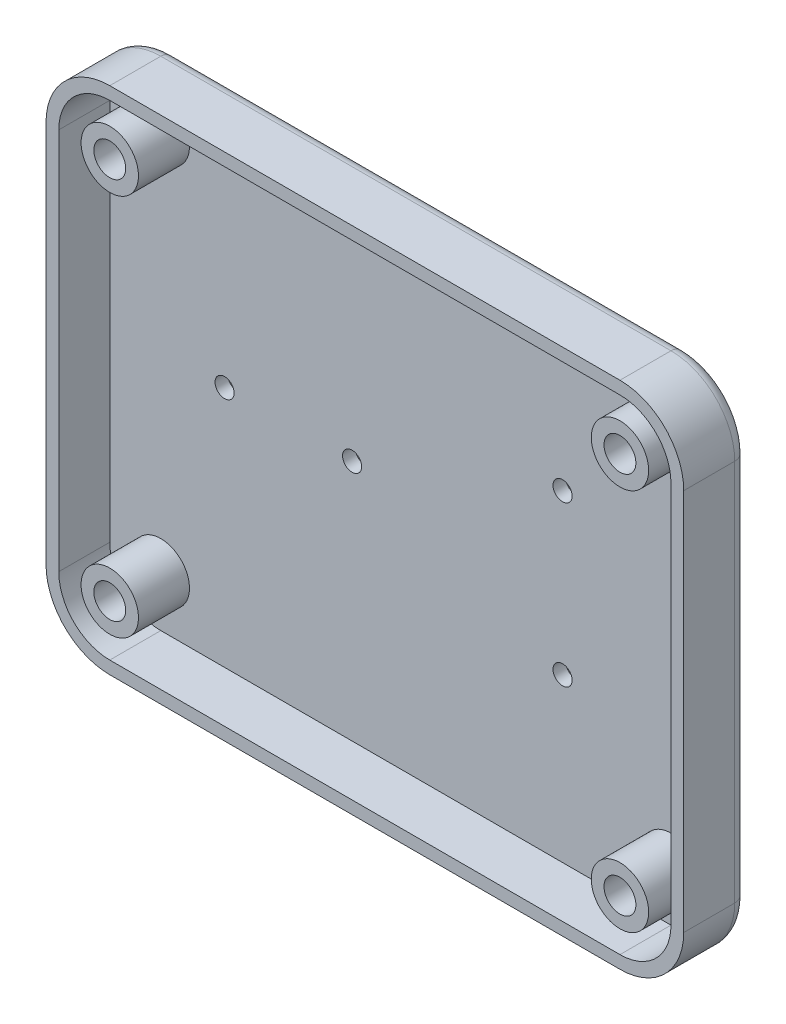
ISO-10303-21;
HEADER;
FILE_DESCRIPTION(('STEP AP214'),'2;1');
FILE_NAME('part.step','',(''),(''),'','','');
FILE_SCHEMA(('AUTOMOTIVE_DESIGN { 1 0 10303 214 1 1 1 1 }'));
ENDSEC;
DATA;
#1=APPLICATION_CONTEXT('core data for automotive mechanical design processes');
#2=APPLICATION_PROTOCOL_DEFINITION('international standard','automotive_design',2000,#1);
#3=PRODUCT_CONTEXT('',#1,'mechanical');
#4=PRODUCT('Part','Part','',(#3));
#5=PRODUCT_RELATED_PRODUCT_CATEGORY('part','',(#4));
#6=PRODUCT_DEFINITION_FORMATION('','',#4);
#7=PRODUCT_DEFINITION_CONTEXT('part definition',#1,'design');
#8=PRODUCT_DEFINITION('design','',#6,#7);
#9=PRODUCT_DEFINITION_SHAPE('','',#8);
#10=(LENGTH_UNIT() NAMED_UNIT(*) SI_UNIT(.MILLI.,.METRE.));
#11=(NAMED_UNIT(*) PLANE_ANGLE_UNIT() SI_UNIT($,.RADIAN.));
#12=(NAMED_UNIT(*) SI_UNIT($,.STERADIAN.) SOLID_ANGLE_UNIT());
#13=UNCERTAINTY_MEASURE_WITH_UNIT(LENGTH_MEASURE(1.E-05),#10,'distance_accuracy_value','');
#14=(GEOMETRIC_REPRESENTATION_CONTEXT(3) GLOBAL_UNCERTAINTY_ASSIGNED_CONTEXT((#13)) GLOBAL_UNIT_ASSIGNED_CONTEXT((#10,
#11,#12)) REPRESENTATION_CONTEXT('',''));
#15=CARTESIAN_POINT('',(0.,0.,0.));
#16=DIRECTION('',(0.,0.,1.));
#17=DIRECTION('',(1.,0.,0.));
#18=AXIS2_PLACEMENT_3D('',#15,#16,#17);
#19=CARTESIAN_POINT('',(0.,0.,10.));
#20=DIRECTION('',(0.,0.,-1.));
#21=DIRECTION('',(-1.,0.,0.));
#22=AXIS2_PLACEMENT_3D('',#19,#20,#21);
#23=PLANE('',#22);
#24=CARTESIAN_POINT('',(-40.,30.,10.));
#25=DIRECTION('',(0.,0.,-1.));
#26=DIRECTION('',(-1.,0.,0.));
#27=AXIS2_PLACEMENT_3D('',#24,#25,#26);
#28=CIRCLE('',#27,4.5);
#29=CARTESIAN_POINT('',(-44.5,30.,10.));
#30=VERTEX_POINT('',#29);
#31=EDGE_CURVE('E226',#30,#30,#28,.T.);
#32=ORIENTED_EDGE('',*,*,#31,.F.);
#33=EDGE_LOOP('',(#32));
#34=FACE_BOUND('',#33,.T.);
#35=CARTESIAN_POINT('',(-40.,30.,10.));
#36=DIRECTION('',(0.,0.,-1.));
#37=DIRECTION('',(-1.,0.,0.));
#38=AXIS2_PLACEMENT_3D('',#35,#36,#37);
#39=CIRCLE('',#38,2.5);
#40=CARTESIAN_POINT('',(-42.5,30.,10.));
#41=VERTEX_POINT('',#40);
#42=EDGE_CURVE('E286',#41,#41,#39,.T.);
#43=ORIENTED_EDGE('',*,*,#42,.T.);
#44=EDGE_LOOP('',(#43));
#45=FACE_BOUND('',#44,.T.);
#46=ADVANCED_FACE('F35',(#34,#45),#23,.F.);
#47=CARTESIAN_POINT('',(40.,30.,10.));
#48=DIRECTION('',(0.,0.,-1.));
#49=DIRECTION('',(-1.,0.,0.));
#50=AXIS2_PLACEMENT_3D('',#47,#48,#49);
#51=CIRCLE('',#50,4.5);
#52=CARTESIAN_POINT('',(35.5,30.,10.));
#53=VERTEX_POINT('',#52);
#54=EDGE_CURVE('E231',#53,#53,#51,.T.);
#55=ORIENTED_EDGE('',*,*,#54,.F.);
#56=EDGE_LOOP('',(#55));
#57=FACE_BOUND('',#56,.T.);
#58=CARTESIAN_POINT('',(40.,30.,10.));
#59=DIRECTION('',(0.,0.,-1.));
#60=DIRECTION('',(-1.,0.,0.));
#61=AXIS2_PLACEMENT_3D('',#58,#59,#60);
#62=CIRCLE('',#61,2.5);
#63=CARTESIAN_POINT('',(37.5,30.,10.));
#64=VERTEX_POINT('',#63);
#65=EDGE_CURVE('E280',#64,#64,#62,.T.);
#66=ORIENTED_EDGE('',*,*,#65,.T.);
#67=EDGE_LOOP('',(#66));
#68=FACE_BOUND('',#67,.T.);
#69=ADVANCED_FACE('F455',(#57,#68),#23,.F.);
#70=CARTESIAN_POINT('',(40.,-30.,10.));
#71=DIRECTION('',(0.,0.,-1.));
#72=DIRECTION('',(-1.,0.,0.));
#73=AXIS2_PLACEMENT_3D('',#70,#71,#72);
#74=CIRCLE('',#73,4.5);
#75=CARTESIAN_POINT('',(35.5,-30.,10.));
#76=VERTEX_POINT('',#75);
#77=EDGE_CURVE('E235',#76,#76,#74,.T.);
#78=ORIENTED_EDGE('',*,*,#77,.F.);
#79=EDGE_LOOP('',(#78));
#80=FACE_BOUND('',#79,.T.);
#81=CARTESIAN_POINT('',(40.,-30.,10.));
#82=DIRECTION('',(0.,0.,-1.));
#83=DIRECTION('',(-1.,0.,0.));
#84=AXIS2_PLACEMENT_3D('',#81,#82,#83);
#85=CIRCLE('',#84,2.5);
#86=CARTESIAN_POINT('',(37.5,-30.,10.));
#87=VERTEX_POINT('',#86);
#88=EDGE_CURVE('E273',#87,#87,#85,.T.);
#89=ORIENTED_EDGE('',*,*,#88,.T.);
#90=EDGE_LOOP('',(#89));
#91=FACE_BOUND('',#90,.T.);
#92=ADVANCED_FACE('F461',(#80,#91),#23,.F.);
#93=CARTESIAN_POINT('',(-40.,-30.,10.));
#94=DIRECTION('',(0.,0.,-1.));
#95=DIRECTION('',(-1.,0.,0.));
#96=AXIS2_PLACEMENT_3D('',#93,#94,#95);
#97=CIRCLE('',#96,4.5);
#98=CARTESIAN_POINT('',(-44.5,-30.,10.));
#99=VERTEX_POINT('',#98);
#100=EDGE_CURVE('E239',#99,#99,#97,.T.);
#101=ORIENTED_EDGE('',*,*,#100,.F.);
#102=EDGE_LOOP('',(#101));
#103=FACE_BOUND('',#102,.T.);
#104=CARTESIAN_POINT('',(-40.,-30.,10.));
#105=DIRECTION('',(0.,0.,-1.));
#106=DIRECTION('',(-1.,0.,0.));
#107=AXIS2_PLACEMENT_3D('',#104,#105,#106);
#108=CIRCLE('',#107,2.5);
#109=CARTESIAN_POINT('',(-42.5,-30.,10.));
#110=VERTEX_POINT('',#109);
#111=EDGE_CURVE('E292',#110,#110,#108,.T.);
#112=ORIENTED_EDGE('',*,*,#111,.T.);
#113=EDGE_LOOP('',(#112));
#114=FACE_BOUND('',#113,.T.);
#115=ADVANCED_FACE('F470',(#103,#114),#23,.F.);
#116=CARTESIAN_POINT('',(50.,-40.,10.));
#117=DIRECTION('',(-1.,0.,0.));
#118=DIRECTION('',(0.,0.,1.));
#119=AXIS2_PLACEMENT_3D('',#116,#117,#118);
#120=PLANE('',#119);
#121=DIRECTION('',(0.,0.,-1.));
#122=VECTOR('',#121,1.);
#123=CARTESIAN_POINT('',(50.,-30.,10.));
#124=LINE('',#123,#122);
#125=CARTESIAN_POINT('',(50.,-30.,10.));
#126=VERTEX_POINT('',#125);
#127=CARTESIAN_POINT('',(50.,-30.,2.));
#128=VERTEX_POINT('',#127);
#129=EDGE_CURVE('E329',#126,#128,#124,.T.);
#130=ORIENTED_EDGE('',*,*,#129,.T.);
#131=DIRECTION('',(0.,1.,0.));
#132=VECTOR('',#131,1.);
#133=CARTESIAN_POINT('',(50.,30.,2.));
#134=LINE('',#133,#132);
#135=CARTESIAN_POINT('',(50.,30.,2.));
#136=VERTEX_POINT('',#135);
#137=EDGE_CURVE('E356',#128,#136,#134,.T.);
#138=ORIENTED_EDGE('',*,*,#137,.T.);
#139=DIRECTION('',(0.,0.,-1.));
#140=VECTOR('',#139,1.);
#141=CARTESIAN_POINT('',(50.,30.,10.));
#142=LINE('',#141,#140);
#143=CARTESIAN_POINT('',(50.,30.,10.));
#144=VERTEX_POINT('',#143);
#145=EDGE_CURVE('E327',#136,#144,#142,.F.);
#146=ORIENTED_EDGE('',*,*,#145,.T.);
#147=DIRECTION('',(0.,1.,0.));
#148=VECTOR('',#147,1.);
#149=CARTESIAN_POINT('',(50.,-40.,10.));
#150=LINE('',#149,#148);
#151=EDGE_CURVE('E295',#126,#144,#150,.T.);
#152=ORIENTED_EDGE('',*,*,#151,.F.);
#153=EDGE_LOOP('',(#130,#138,#146,#152));
#154=FACE_BOUND('',#153,.T.);
#155=ADVANCED_FACE('F417',(#154),#120,.F.);
#156=CARTESIAN_POINT('',(-50.,40.,10.));
#157=DIRECTION('',(0.,-1.,0.));
#158=DIRECTION('',(0.,0.,-1.));
#159=AXIS2_PLACEMENT_3D('',#156,#157,#158);
#160=PLANE('',#159);
#161=DIRECTION('',(0.,0.,-1.));
#162=VECTOR('',#161,1.);
#163=CARTESIAN_POINT('',(40.,40.,10.));
#164=LINE('',#163,#162);
#165=CARTESIAN_POINT('',(40.,40.,10.));
#166=VERTEX_POINT('',#165);
#167=CARTESIAN_POINT('',(40.,40.,2.));
#168=VERTEX_POINT('',#167);
#169=EDGE_CURVE('E334',#166,#168,#164,.T.);
#170=ORIENTED_EDGE('',*,*,#169,.T.);
#171=DIRECTION('',(-1.,0.,0.));
#172=VECTOR('',#171,1.);
#173=CARTESIAN_POINT('',(-40.,40.,2.));
#174=LINE('',#173,#172);
#175=CARTESIAN_POINT('',(-40.,40.,2.));
#176=VERTEX_POINT('',#175);
#177=EDGE_CURVE('E11',#168,#176,#174,.T.);
#178=ORIENTED_EDGE('',*,*,#177,.T.);
#179=DIRECTION('',(0.,0.,-1.));
#180=VECTOR('',#179,1.);
#181=CARTESIAN_POINT('',(-40.,40.,10.));
#182=LINE('',#181,#180);
#183=CARTESIAN_POINT('',(-40.,40.,10.));
#184=VERTEX_POINT('',#183);
#185=EDGE_CURVE('E332',#176,#184,#182,.F.);
#186=ORIENTED_EDGE('',*,*,#185,.T.);
#187=DIRECTION('',(-1.,0.,0.));
#188=VECTOR('',#187,1.);
#189=CARTESIAN_POINT('',(-50.,40.,10.));
#190=LINE('',#189,#188);
#191=EDGE_CURVE('E300',#166,#184,#190,.T.);
#192=ORIENTED_EDGE('',*,*,#191,.F.);
#193=EDGE_LOOP('',(#170,#178,#186,#192));
#194=FACE_BOUND('',#193,.T.);
#195=ADVANCED_FACE('F437',(#194),#160,.F.);
#196=CARTESIAN_POINT('',(-50.,-40.,10.));
#197=DIRECTION('',(1.,0.,0.));
#198=DIRECTION('',(0.,0.,-1.));
#199=AXIS2_PLACEMENT_3D('',#196,#197,#198);
#200=PLANE('',#199);
#201=DIRECTION('',(0.,0.,-1.));
#202=VECTOR('',#201,1.);
#203=CARTESIAN_POINT('',(-50.,30.,10.));
#204=LINE('',#203,#202);
#205=CARTESIAN_POINT('',(-50.,30.,10.));
#206=VERTEX_POINT('',#205);
#207=CARTESIAN_POINT('',(-50.,30.,2.));
#208=VERTEX_POINT('',#207);
#209=EDGE_CURVE('E314',#206,#208,#204,.T.);
#210=ORIENTED_EDGE('',*,*,#209,.T.);
#211=DIRECTION('',(0.,-1.,0.));
#212=VECTOR('',#211,1.);
#213=CARTESIAN_POINT('',(-50.,-30.,2.));
#214=LINE('',#213,#212);
#215=CARTESIAN_POINT('',(-50.,-30.,2.));
#216=VERTEX_POINT('',#215);
#217=EDGE_CURVE('E364',#208,#216,#214,.T.);
#218=ORIENTED_EDGE('',*,*,#217,.T.);
#219=DIRECTION('',(0.,0.,-1.));
#220=VECTOR('',#219,1.);
#221=CARTESIAN_POINT('',(-50.,-30.,10.));
#222=LINE('',#221,#220);
#223=CARTESIAN_POINT('',(-50.,-30.,10.));
#224=VERTEX_POINT('',#223);
#225=EDGE_CURVE('E317',#216,#224,#222,.F.);
#226=ORIENTED_EDGE('',*,*,#225,.T.);
#227=DIRECTION('',(0.,-1.,0.));
#228=VECTOR('',#227,1.);
#229=CARTESIAN_POINT('',(-50.,-40.,10.));
#230=LINE('',#229,#228);
#231=EDGE_CURVE('E303',#206,#224,#230,.T.);
#232=ORIENTED_EDGE('',*,*,#231,.F.);
#233=EDGE_LOOP('',(#210,#218,#226,#232));
#234=FACE_BOUND('',#233,.T.);
#235=ADVANCED_FACE('F445',(#234),#200,.F.);
#236=CARTESIAN_POINT('',(-50.,-40.,10.));
#237=DIRECTION('',(0.,1.,0.));
#238=DIRECTION('',(0.,0.,1.));
#239=AXIS2_PLACEMENT_3D('',#236,#237,#238);
#240=PLANE('',#239);
#241=DIRECTION('',(0.,0.,-1.));
#242=VECTOR('',#241,1.);
#243=CARTESIAN_POINT('',(-40.,-40.,10.));
#244=LINE('',#243,#242);
#245=CARTESIAN_POINT('',(-40.,-40.,10.));
#246=VERTEX_POINT('',#245);
#247=CARTESIAN_POINT('',(-40.,-40.,2.));
#248=VERTEX_POINT('',#247);
#249=EDGE_CURVE('E311',#246,#248,#244,.T.);
#250=ORIENTED_EDGE('',*,*,#249,.T.);
#251=DIRECTION('',(1.,0.,0.));
#252=VECTOR('',#251,1.);
#253=CARTESIAN_POINT('',(40.,-40.,2.));
#254=LINE('',#253,#252);
#255=CARTESIAN_POINT('',(40.,-40.,2.));
#256=VERTEX_POINT('',#255);
#257=EDGE_CURVE('E360',#248,#256,#254,.T.);
#258=ORIENTED_EDGE('',*,*,#257,.T.);
#259=DIRECTION('',(0.,0.,-1.));
#260=VECTOR('',#259,1.);
#261=CARTESIAN_POINT('',(40.,-40.,10.));
#262=LINE('',#261,#260);
#263=CARTESIAN_POINT('',(40.,-40.,10.));
#264=VERTEX_POINT('',#263);
#265=EDGE_CURVE('E309',#256,#264,#262,.F.);
#266=ORIENTED_EDGE('',*,*,#265,.T.);
#267=DIRECTION('',(1.,0.,0.));
#268=VECTOR('',#267,1.);
#269=CARTESIAN_POINT('',(-50.,-40.,10.));
#270=LINE('',#269,#268);
#271=EDGE_CURVE('E306',#246,#264,#270,.T.);
#272=ORIENTED_EDGE('',*,*,#271,.F.);
#273=EDGE_LOOP('',(#250,#258,#266,#272));
#274=FACE_BOUND('',#273,.T.);
#275=ADVANCED_FACE('F404',(#274),#240,.F.);
#276=DIRECTION('',(0.,-1.,0.));
#277=VECTOR('',#276,1.);
#278=CARTESIAN_POINT('',(-48.,0.,10.));
#279=LINE('',#278,#277);
#280=CARTESIAN_POINT('',(-48.,30.,10.));
#281=VERTEX_POINT('',#280);
#282=CARTESIAN_POINT('',(-48.,-30.,10.));
#283=VERTEX_POINT('',#282);
#284=EDGE_CURVE('E257',#281,#283,#279,.T.);
#285=ORIENTED_EDGE('',*,*,#284,.F.);
#286=CARTESIAN_POINT('',(-40.,30.,10.));
#287=DIRECTION('',(0.,0.,-1.));
#288=DIRECTION('',(-1.,0.,0.));
#289=AXIS2_PLACEMENT_3D('',#286,#287,#288);
#290=CIRCLE('',#289,8.);
#291=CARTESIAN_POINT('',(-40.,38.,10.));
#292=VERTEX_POINT('',#291);
#293=EDGE_CURVE('E246',#292,#281,#290,.F.);
#294=ORIENTED_EDGE('',*,*,#293,.F.);
#295=DIRECTION('',(-1.,0.,0.));
#296=VECTOR('',#295,1.);
#297=CARTESIAN_POINT('',(0.,38.,10.));
#298=LINE('',#297,#296);
#299=CARTESIAN_POINT('',(40.,38.,10.));
#300=VERTEX_POINT('',#299);
#301=EDGE_CURVE('E52',#300,#292,#298,.T.);
#302=ORIENTED_EDGE('',*,*,#301,.F.);
#303=CARTESIAN_POINT('',(40.,30.,10.));
#304=DIRECTION('',(0.,0.,-1.));
#305=DIRECTION('',(-1.,0.,0.));
#306=AXIS2_PLACEMENT_3D('',#303,#304,#305);
#307=CIRCLE('',#306,8.);
#308=CARTESIAN_POINT('',(48.,30.,10.));
#309=VERTEX_POINT('',#308);
#310=EDGE_CURVE('E254',#309,#300,#307,.F.);
#311=ORIENTED_EDGE('',*,*,#310,.F.);
#312=DIRECTION('',(0.,1.,0.));
#313=VECTOR('',#312,1.);
#314=CARTESIAN_POINT('',(48.,0.,10.));
#315=LINE('',#314,#313);
#316=CARTESIAN_POINT('',(48.,-30.,10.));
#317=VERTEX_POINT('',#316);
#318=EDGE_CURVE('E252',#317,#309,#315,.T.);
#319=ORIENTED_EDGE('',*,*,#318,.F.);
#320=CARTESIAN_POINT('',(40.,-30.,10.));
#321=DIRECTION('',(0.,0.,-1.));
#322=DIRECTION('',(-1.,0.,0.));
#323=AXIS2_PLACEMENT_3D('',#320,#321,#322);
#324=CIRCLE('',#323,8.);
#325=CARTESIAN_POINT('',(40.,-38.,10.));
#326=VERTEX_POINT('',#325);
#327=EDGE_CURVE('E199',#326,#317,#324,.F.);
#328=ORIENTED_EDGE('',*,*,#327,.F.);
#329=DIRECTION('',(1.,0.,0.));
#330=VECTOR('',#329,1.);
#331=CARTESIAN_POINT('',(0.,-38.,10.));
#332=LINE('',#331,#330);
#333=CARTESIAN_POINT('',(-40.,-38.,10.));
#334=VERTEX_POINT('',#333);
#335=EDGE_CURVE('E251',#334,#326,#332,.T.);
#336=ORIENTED_EDGE('',*,*,#335,.F.);
#337=CARTESIAN_POINT('',(-40.,-30.,10.));
#338=DIRECTION('',(0.,0.,-1.));
#339=DIRECTION('',(-1.,0.,0.));
#340=AXIS2_PLACEMENT_3D('',#337,#338,#339);
#341=CIRCLE('',#340,8.);
#342=EDGE_CURVE('E204',#283,#334,#341,.F.);
#343=ORIENTED_EDGE('',*,*,#342,.F.);
#344=EDGE_LOOP('',(#285,#294,#302,#311,#319,#328,#336,#343));
#345=FACE_BOUND('',#344,.T.);
#346=ORIENTED_EDGE('',*,*,#231,.T.);
#347=CARTESIAN_POINT('',(-40.,-30.,10.));
#348=DIRECTION('',(0.,0.,-1.));
#349=DIRECTION('',(-1.,0.,0.));
#350=AXIS2_PLACEMENT_3D('',#347,#348,#349);
#351=CIRCLE('',#350,10.);
#352=EDGE_CURVE('E325',#224,#246,#351,.F.);
#353=ORIENTED_EDGE('',*,*,#352,.T.);
#354=ORIENTED_EDGE('',*,*,#271,.T.);
#355=CARTESIAN_POINT('',(40.,-30.,10.));
#356=DIRECTION('',(0.,0.,-1.));
#357=DIRECTION('',(-1.,0.,0.));
#358=AXIS2_PLACEMENT_3D('',#355,#356,#357);
#359=CIRCLE('',#358,10.);
#360=EDGE_CURVE('E323',#264,#126,#359,.F.);
#361=ORIENTED_EDGE('',*,*,#360,.T.);
#362=ORIENTED_EDGE('',*,*,#151,.T.);
#363=CARTESIAN_POINT('',(40.,30.,10.));
#364=DIRECTION('',(0.,0.,-1.));
#365=DIRECTION('',(-1.,0.,0.));
#366=AXIS2_PLACEMENT_3D('',#363,#364,#365);
#367=CIRCLE('',#366,10.);
#368=EDGE_CURVE('E321',#144,#166,#367,.F.);
#369=ORIENTED_EDGE('',*,*,#368,.T.);
#370=ORIENTED_EDGE('',*,*,#191,.T.);
#371=CARTESIAN_POINT('',(-40.,30.,10.));
#372=DIRECTION('',(0.,0.,-1.));
#373=DIRECTION('',(-1.,0.,0.));
#374=AXIS2_PLACEMENT_3D('',#371,#372,#373);
#375=CIRCLE('',#374,10.);
#376=EDGE_CURVE('E319',#184,#206,#375,.F.);
#377=ORIENTED_EDGE('',*,*,#376,.T.);
#378=EDGE_LOOP('',(#346,#353,#354,#361,#362,#369,#370,#377));
#379=FACE_BOUND('',#378,.T.);
#380=ADVANCED_FACE('F408',(#345,#379),#23,.F.);
#381=CARTESIAN_POINT('',(0.,0.,0.));
#382=DIRECTION('',(0.,0.,-1.));
#383=DIRECTION('',(-1.,0.,0.));
#384=AXIS2_PLACEMENT_3D('',#381,#382,#383);
#385=PLANE('',#384);
#386=CARTESIAN_POINT('',(23.,-12.5,0.));
#387=DIRECTION('',(0.,0.,1.));
#388=DIRECTION('',(1.,0.,0.));
#389=AXIS2_PLACEMENT_3D('',#386,#387,#388);
#390=CIRCLE('',#389,1.5);
#391=CARTESIAN_POINT('',(24.5,-12.5,0.));
#392=VERTEX_POINT('',#391);
#393=EDGE_CURVE('E590',#392,#392,#390,.T.);
#394=ORIENTED_EDGE('',*,*,#393,.T.);
#395=EDGE_LOOP('',(#394));
#396=FACE_BOUND('',#395,.T.);
#397=CARTESIAN_POINT('',(23.,12.5,0.));
#398=DIRECTION('',(0.,0.,1.));
#399=DIRECTION('',(1.,0.,0.));
#400=AXIS2_PLACEMENT_3D('',#397,#398,#399);
#401=CIRCLE('',#400,1.5);
#402=CARTESIAN_POINT('',(24.5,12.5,0.));
#403=VERTEX_POINT('',#402);
#404=EDGE_CURVE('E581',#403,#403,#401,.T.);
#405=ORIENTED_EDGE('',*,*,#404,.T.);
#406=EDGE_LOOP('',(#405));
#407=FACE_BOUND('',#406,.T.);
#408=CARTESIAN_POINT('',(-30.,0.,0.));
#409=DIRECTION('',(0.,0.,1.));
#410=DIRECTION('',(1.,0.,0.));
#411=AXIS2_PLACEMENT_3D('',#408,#409,#410);
#412=CIRCLE('',#411,1.5);
#413=CARTESIAN_POINT('',(-28.5,0.,0.));
#414=VERTEX_POINT('',#413);
#415=EDGE_CURVE('E576',#414,#414,#412,.T.);
#416=ORIENTED_EDGE('',*,*,#415,.T.);
#417=EDGE_LOOP('',(#416));
#418=FACE_BOUND('',#417,.T.);
#419=CARTESIAN_POINT('',(-10.,0.,0.));
#420=DIRECTION('',(0.,0.,1.));
#421=DIRECTION('',(1.,0.,0.));
#422=AXIS2_PLACEMENT_3D('',#419,#420,#421);
#423=CIRCLE('',#422,1.5);
#424=CARTESIAN_POINT('',(-8.5,0.,0.));
#425=VERTEX_POINT('',#424);
#426=EDGE_CURVE('E227',#425,#425,#423,.T.);
#427=ORIENTED_EDGE('',*,*,#426,.T.);
#428=EDGE_LOOP('',(#427));
#429=FACE_BOUND('',#428,.T.);
#430=DIRECTION('',(-1.,0.,0.));
#431=VECTOR('',#430,1.);
#432=CARTESIAN_POINT('',(40.,38.,0.));
#433=LINE('',#432,#431);
#434=CARTESIAN_POINT('',(-40.,38.,0.));
#435=VERTEX_POINT('',#434);
#436=CARTESIAN_POINT('',(40.,38.,0.));
#437=VERTEX_POINT('',#436);
#438=EDGE_CURVE('E336',#435,#437,#433,.F.);
#439=ORIENTED_EDGE('',*,*,#438,.T.);
#440=CARTESIAN_POINT('',(40.,30.,0.));
#441=DIRECTION('',(0.,0.,-1.));
#442=DIRECTION('',(-1.,0.,0.));
#443=AXIS2_PLACEMENT_3D('',#440,#441,#442);
#444=CIRCLE('',#443,8.);
#445=CARTESIAN_POINT('',(48.,30.,0.));
#446=VERTEX_POINT('',#445);
#447=EDGE_CURVE('E350',#437,#446,#444,.T.);
#448=ORIENTED_EDGE('',*,*,#447,.T.);
#449=DIRECTION('',(0.,1.,0.));
#450=VECTOR('',#449,1.);
#451=CARTESIAN_POINT('',(48.,-30.,0.));
#452=LINE('',#451,#450);
#453=CARTESIAN_POINT('',(48.,-30.,0.));
#454=VERTEX_POINT('',#453);
#455=EDGE_CURVE('E348',#446,#454,#452,.F.);
#456=ORIENTED_EDGE('',*,*,#455,.T.);
#457=CARTESIAN_POINT('',(40.,-30.,0.));
#458=DIRECTION('',(0.,0.,-1.));
#459=DIRECTION('',(-1.,0.,0.));
#460=AXIS2_PLACEMENT_3D('',#457,#458,#459);
#461=CIRCLE('',#460,8.);
#462=CARTESIAN_POINT('',(40.,-38.,0.));
#463=VERTEX_POINT('',#462);
#464=EDGE_CURVE('E346',#454,#463,#461,.T.);
#465=ORIENTED_EDGE('',*,*,#464,.T.);
#466=DIRECTION('',(1.,0.,0.));
#467=VECTOR('',#466,1.);
#468=CARTESIAN_POINT('',(-40.,-38.,0.));
#469=LINE('',#468,#467);
#470=CARTESIAN_POINT('',(-40.,-38.,0.));
#471=VERTEX_POINT('',#470);
#472=EDGE_CURVE('E344',#463,#471,#469,.F.);
#473=ORIENTED_EDGE('',*,*,#472,.T.);
#474=CARTESIAN_POINT('',(-40.,-30.,0.));
#475=DIRECTION('',(0.,0.,-1.));
#476=DIRECTION('',(-1.,0.,0.));
#477=AXIS2_PLACEMENT_3D('',#474,#475,#476);
#478=CIRCLE('',#477,8.);
#479=CARTESIAN_POINT('',(-48.,-30.,0.));
#480=VERTEX_POINT('',#479);
#481=EDGE_CURVE('E342',#471,#480,#478,.T.);
#482=ORIENTED_EDGE('',*,*,#481,.T.);
#483=DIRECTION('',(0.,-1.,0.));
#484=VECTOR('',#483,1.);
#485=CARTESIAN_POINT('',(-48.,30.,0.));
#486=LINE('',#485,#484);
#487=CARTESIAN_POINT('',(-48.,30.,0.));
#488=VERTEX_POINT('',#487);
#489=EDGE_CURVE('E340',#480,#488,#486,.F.);
#490=ORIENTED_EDGE('',*,*,#489,.T.);
#491=CARTESIAN_POINT('',(-40.,30.,0.));
#492=DIRECTION('',(0.,0.,-1.));
#493=DIRECTION('',(-1.,0.,0.));
#494=AXIS2_PLACEMENT_3D('',#491,#492,#493);
#495=CIRCLE('',#494,8.);
#496=EDGE_CURVE('E338',#488,#435,#495,.T.);
#497=ORIENTED_EDGE('',*,*,#496,.T.);
#498=EDGE_LOOP('',(#439,#448,#456,#465,#473,#482,#490,#497));
#499=FACE_BOUND('',#498,.T.);
#500=CARTESIAN_POINT('',(-40.,30.,0.));
#501=DIRECTION('',(0.,0.,-1.));
#502=DIRECTION('',(-1.,0.,0.));
#503=AXIS2_PLACEMENT_3D('',#500,#501,#502);
#504=CIRCLE('',#503,2.5);
#505=CARTESIAN_POINT('',(-42.5,30.,0.));
#506=VERTEX_POINT('',#505);
#507=EDGE_CURVE('E289',#506,#506,#504,.T.);
#508=ORIENTED_EDGE('',*,*,#507,.F.);
#509=EDGE_LOOP('',(#508));
#510=FACE_BOUND('',#509,.T.);
#511=CARTESIAN_POINT('',(40.,30.,0.));
#512=DIRECTION('',(0.,0.,-1.));
#513=DIRECTION('',(-1.,0.,0.));
#514=AXIS2_PLACEMENT_3D('',#511,#512,#513);
#515=CIRCLE('',#514,2.5);
#516=CARTESIAN_POINT('',(37.5,30.,0.));
#517=VERTEX_POINT('',#516);
#518=EDGE_CURVE('E283',#517,#517,#515,.T.);
#519=ORIENTED_EDGE('',*,*,#518,.F.);
#520=EDGE_LOOP('',(#519));
#521=FACE_BOUND('',#520,.T.);
#522=CARTESIAN_POINT('',(40.,-30.,0.));
#523=DIRECTION('',(0.,0.,-1.));
#524=DIRECTION('',(-1.,0.,0.));
#525=AXIS2_PLACEMENT_3D('',#522,#523,#524);
#526=CIRCLE('',#525,2.5);
#527=CARTESIAN_POINT('',(37.5,-30.,0.));
#528=VERTEX_POINT('',#527);
#529=EDGE_CURVE('E277',#528,#528,#526,.T.);
#530=ORIENTED_EDGE('',*,*,#529,.F.);
#531=EDGE_LOOP('',(#530));
#532=FACE_BOUND('',#531,.T.);
#533=CARTESIAN_POINT('',(-40.,-30.,0.));
#534=DIRECTION('',(0.,0.,-1.));
#535=DIRECTION('',(-1.,0.,0.));
#536=AXIS2_PLACEMENT_3D('',#533,#534,#535);
#537=CIRCLE('',#536,2.5);
#538=CARTESIAN_POINT('',(-42.5,-30.,0.));
#539=VERTEX_POINT('',#538);
#540=EDGE_CURVE('E276',#539,#539,#537,.T.);
#541=ORIENTED_EDGE('',*,*,#540,.F.);
#542=EDGE_LOOP('',(#541));
#543=FACE_BOUND('',#542,.T.);
#544=ADVANCED_FACE('F468',(#396,#407,#418,#429,#499,#510,#521,#532,#543),#385,.T.);
#545=CARTESIAN_POINT('',(-40.,-30.,10.));
#546=DIRECTION('',(0.,0.,-1.));
#547=DIRECTION('',(-1.,0.,0.));
#548=AXIS2_PLACEMENT_3D('',#545,#546,#547);
#549=CYLINDRICAL_SURFACE('',#548,10.);
#550=ORIENTED_EDGE('',*,*,#225,.F.);
#551=CARTESIAN_POINT('',(-40.,-30.,2.));
#552=DIRECTION('',(0.,0.,-1.));
#553=DIRECTION('',(-1.,0.,0.));
#554=AXIS2_PLACEMENT_3D('',#551,#552,#553);
#555=CIRCLE('',#554,10.);
#556=EDGE_CURVE('E362',#216,#248,#555,.F.);
#557=ORIENTED_EDGE('',*,*,#556,.T.);
#558=ORIENTED_EDGE('',*,*,#249,.F.);
#559=ORIENTED_EDGE('',*,*,#352,.F.);
#560=EDGE_LOOP('',(#550,#557,#558,#559));
#561=FACE_BOUND('',#560,.T.);
#562=ADVANCED_FACE('F400',(#561),#549,.T.);
#563=CARTESIAN_POINT('',(40.,-30.,10.));
#564=DIRECTION('',(0.,0.,-1.));
#565=DIRECTION('',(-1.,0.,0.));
#566=AXIS2_PLACEMENT_3D('',#563,#564,#565);
#567=CYLINDRICAL_SURFACE('',#566,10.);
#568=ORIENTED_EDGE('',*,*,#265,.F.);
#569=CARTESIAN_POINT('',(40.,-30.,2.));
#570=DIRECTION('',(0.,0.,-1.));
#571=DIRECTION('',(-1.,0.,0.));
#572=AXIS2_PLACEMENT_3D('',#569,#570,#571);
#573=CIRCLE('',#572,10.);
#574=EDGE_CURVE('E358',#256,#128,#573,.F.);
#575=ORIENTED_EDGE('',*,*,#574,.T.);
#576=ORIENTED_EDGE('',*,*,#129,.F.);
#577=ORIENTED_EDGE('',*,*,#360,.F.);
#578=EDGE_LOOP('',(#568,#575,#576,#577));
#579=FACE_BOUND('',#578,.T.);
#580=ADVANCED_FACE('F412',(#579),#567,.T.);
#581=CARTESIAN_POINT('',(40.,30.,10.));
#582=DIRECTION('',(0.,0.,-1.));
#583=DIRECTION('',(-1.,0.,0.));
#584=AXIS2_PLACEMENT_3D('',#581,#582,#583);
#585=CYLINDRICAL_SURFACE('',#584,10.);
#586=ORIENTED_EDGE('',*,*,#145,.F.);
#587=CARTESIAN_POINT('',(40.,30.,2.));
#588=DIRECTION('',(0.,0.,-1.));
#589=DIRECTION('',(-1.,0.,0.));
#590=AXIS2_PLACEMENT_3D('',#587,#588,#589);
#591=CIRCLE('',#590,10.);
#592=EDGE_CURVE('E353',#136,#168,#591,.F.);
#593=ORIENTED_EDGE('',*,*,#592,.T.);
#594=ORIENTED_EDGE('',*,*,#169,.F.);
#595=ORIENTED_EDGE('',*,*,#368,.F.);
#596=EDGE_LOOP('',(#586,#593,#594,#595));
#597=FACE_BOUND('',#596,.T.);
#598=ADVANCED_FACE('F434',(#597),#585,.T.);
#599=CARTESIAN_POINT('',(-40.,30.,10.));
#600=DIRECTION('',(0.,0.,-1.));
#601=DIRECTION('',(-1.,0.,0.));
#602=AXIS2_PLACEMENT_3D('',#599,#600,#601);
#603=CYLINDRICAL_SURFACE('',#602,10.);
#604=ORIENTED_EDGE('',*,*,#185,.F.);
#605=CARTESIAN_POINT('',(-40.,30.,2.));
#606=DIRECTION('',(0.,0.,-1.));
#607=DIRECTION('',(-1.,0.,0.));
#608=AXIS2_PLACEMENT_3D('',#605,#606,#607);
#609=CIRCLE('',#608,10.);
#610=EDGE_CURVE('E44',#176,#208,#609,.F.);
#611=ORIENTED_EDGE('',*,*,#610,.T.);
#612=ORIENTED_EDGE('',*,*,#209,.F.);
#613=ORIENTED_EDGE('',*,*,#376,.F.);
#614=EDGE_LOOP('',(#604,#611,#612,#613));
#615=FACE_BOUND('',#614,.T.);
#616=ADVANCED_FACE('F442',(#615),#603,.T.);
#617=CARTESIAN_POINT('',(-40.,-30.,10.));
#618=DIRECTION('',(0.,0.,-1.));
#619=DIRECTION('',(-1.,0.,0.));
#620=AXIS2_PLACEMENT_3D('',#617,#618,#619);
#621=CYLINDRICAL_SURFACE('',#620,2.5);
#622=ORIENTED_EDGE('',*,*,#111,.F.);
#623=EDGE_LOOP('',(#622));
#624=FACE_BOUND('',#623,.T.);
#625=ORIENTED_EDGE('',*,*,#540,.T.);
#626=EDGE_LOOP('',(#625));
#627=FACE_BOUND('',#626,.T.);
#628=ADVANCED_FACE('F488',(#624,#627),#621,.F.);
#629=CARTESIAN_POINT('',(40.,-30.,10.));
#630=DIRECTION('',(0.,0.,-1.));
#631=DIRECTION('',(-1.,0.,0.));
#632=AXIS2_PLACEMENT_3D('',#629,#630,#631);
#633=CYLINDRICAL_SURFACE('',#632,2.5);
#634=ORIENTED_EDGE('',*,*,#88,.F.);
#635=EDGE_LOOP('',(#634));
#636=FACE_BOUND('',#635,.T.);
#637=ORIENTED_EDGE('',*,*,#529,.T.);
#638=EDGE_LOOP('',(#637));
#639=FACE_BOUND('',#638,.T.);
#640=ADVANCED_FACE('F491',(#636,#639),#633,.F.);
#641=CARTESIAN_POINT('',(40.,30.,10.));
#642=DIRECTION('',(0.,0.,-1.));
#643=DIRECTION('',(-1.,0.,0.));
#644=AXIS2_PLACEMENT_3D('',#641,#642,#643);
#645=CYLINDRICAL_SURFACE('',#644,2.5);
#646=ORIENTED_EDGE('',*,*,#65,.F.);
#647=EDGE_LOOP('',(#646));
#648=FACE_BOUND('',#647,.T.);
#649=ORIENTED_EDGE('',*,*,#518,.T.);
#650=EDGE_LOOP('',(#649));
#651=FACE_BOUND('',#650,.T.);
#652=ADVANCED_FACE('F498',(#648,#651),#645,.F.);
#653=CARTESIAN_POINT('',(-40.,30.,10.));
#654=DIRECTION('',(0.,0.,-1.));
#655=DIRECTION('',(-1.,0.,0.));
#656=AXIS2_PLACEMENT_3D('',#653,#654,#655);
#657=CYLINDRICAL_SURFACE('',#656,2.5);
#658=ORIENTED_EDGE('',*,*,#42,.F.);
#659=EDGE_LOOP('',(#658));
#660=FACE_BOUND('',#659,.T.);
#661=ORIENTED_EDGE('',*,*,#507,.T.);
#662=EDGE_LOOP('',(#661));
#663=FACE_BOUND('',#662,.T.);
#664=ADVANCED_FACE('F503',(#660,#663),#657,.F.);
#665=CARTESIAN_POINT('',(-40.,-30.,2.));
#666=DIRECTION('',(0.,0.,-1.));
#667=DIRECTION('',(-1.,0.,0.));
#668=AXIS2_PLACEMENT_3D('',#665,#666,#667);
#669=TOROIDAL_SURFACE('',#668,8.,2.);
#670=CARTESIAN_POINT('',(-40.,-38.,2.));
#671=DIRECTION('',(1.,0.,0.));
#672=DIRECTION('',(0.,0.,-1.));
#673=AXIS2_PLACEMENT_3D('',#670,#671,#672);
#674=CIRCLE('',#673,2.);
#675=EDGE_CURVE('E381',#248,#471,#674,.T.);
#676=ORIENTED_EDGE('',*,*,#675,.F.);
#677=ORIENTED_EDGE('',*,*,#556,.F.);
#678=CARTESIAN_POINT('',(-48.,-30.,2.));
#679=DIRECTION('',(0.,1.,0.));
#680=DIRECTION('',(0.,0.,1.));
#681=AXIS2_PLACEMENT_3D('',#678,#679,#680);
#682=CIRCLE('',#681,2.);
#683=EDGE_CURVE('E39',#480,#216,#682,.T.);
#684=ORIENTED_EDGE('',*,*,#683,.F.);
#685=ORIENTED_EDGE('',*,*,#481,.F.);
#686=EDGE_LOOP('',(#676,#677,#684,#685));
#687=FACE_BOUND('',#686,.T.);
#688=ADVANCED_FACE('F37',(#687),#669,.T.);
#689=CARTESIAN_POINT('',(-48.,-40.,2.));
#690=DIRECTION('',(0.,1.,0.));
#691=DIRECTION('',(0.,0.,1.));
#692=AXIS2_PLACEMENT_3D('',#689,#690,#691);
#693=CYLINDRICAL_SURFACE('',#692,2.);
#694=ORIENTED_EDGE('',*,*,#683,.T.);
#695=ORIENTED_EDGE('',*,*,#217,.F.);
#696=CARTESIAN_POINT('',(-48.,30.,2.));
#697=DIRECTION('',(0.,1.,0.));
#698=DIRECTION('',(0.,0.,1.));
#699=AXIS2_PLACEMENT_3D('',#696,#697,#698);
#700=CIRCLE('',#699,2.);
#701=EDGE_CURVE('E379',#488,#208,#700,.T.);
#702=ORIENTED_EDGE('',*,*,#701,.F.);
#703=ORIENTED_EDGE('',*,*,#489,.F.);
#704=EDGE_LOOP('',(#694,#695,#702,#703));
#705=FACE_BOUND('',#704,.T.);
#706=ADVANCED_FACE('F392',(#705),#693,.T.);
#707=CARTESIAN_POINT('',(-50.,-38.,2.));
#708=DIRECTION('',(-1.,0.,0.));
#709=DIRECTION('',(0.,0.,1.));
#710=AXIS2_PLACEMENT_3D('',#707,#708,#709);
#711=CYLINDRICAL_SURFACE('',#710,2.);
#712=ORIENTED_EDGE('',*,*,#675,.T.);
#713=ORIENTED_EDGE('',*,*,#472,.F.);
#714=CARTESIAN_POINT('',(40.,-38.,2.));
#715=DIRECTION('',(1.,0.,0.));
#716=DIRECTION('',(0.,0.,-1.));
#717=AXIS2_PLACEMENT_3D('',#714,#715,#716);
#718=CIRCLE('',#717,2.);
#719=EDGE_CURVE('E376',#256,#463,#718,.T.);
#720=ORIENTED_EDGE('',*,*,#719,.F.);
#721=ORIENTED_EDGE('',*,*,#257,.F.);
#722=EDGE_LOOP('',(#712,#713,#720,#721));
#723=FACE_BOUND('',#722,.T.);
#724=ADVANCED_FACE('F620',(#723),#711,.T.);
#725=CARTESIAN_POINT('',(-40.,30.,2.));
#726=DIRECTION('',(0.,0.,-1.));
#727=DIRECTION('',(-1.,0.,0.));
#728=AXIS2_PLACEMENT_3D('',#725,#726,#727);
#729=TOROIDAL_SURFACE('',#728,8.,2.);
#730=ORIENTED_EDGE('',*,*,#701,.T.);
#731=ORIENTED_EDGE('',*,*,#610,.F.);
#732=CARTESIAN_POINT('',(-40.,38.,2.));
#733=DIRECTION('',(1.,0.,0.));
#734=DIRECTION('',(0.,0.,-1.));
#735=AXIS2_PLACEMENT_3D('',#732,#733,#734);
#736=CIRCLE('',#735,2.);
#737=EDGE_CURVE('E373',#435,#176,#736,.T.);
#738=ORIENTED_EDGE('',*,*,#737,.F.);
#739=ORIENTED_EDGE('',*,*,#496,.F.);
#740=EDGE_LOOP('',(#730,#731,#738,#739));
#741=FACE_BOUND('',#740,.T.);
#742=ADVANCED_FACE('F618',(#741),#729,.T.);
#743=CARTESIAN_POINT('',(40.,-30.,2.));
#744=DIRECTION('',(0.,0.,-1.));
#745=DIRECTION('',(-1.,0.,0.));
#746=AXIS2_PLACEMENT_3D('',#743,#744,#745);
#747=TOROIDAL_SURFACE('',#746,8.,2.);
#748=ORIENTED_EDGE('',*,*,#719,.T.);
#749=ORIENTED_EDGE('',*,*,#464,.F.);
#750=CARTESIAN_POINT('',(48.,-30.,2.));
#751=DIRECTION('',(0.,1.,0.));
#752=DIRECTION('',(0.,0.,1.));
#753=AXIS2_PLACEMENT_3D('',#750,#751,#752);
#754=CIRCLE('',#753,2.);
#755=EDGE_CURVE('E370',#128,#454,#754,.T.);
#756=ORIENTED_EDGE('',*,*,#755,.F.);
#757=ORIENTED_EDGE('',*,*,#574,.F.);
#758=EDGE_LOOP('',(#748,#749,#756,#757));
#759=FACE_BOUND('',#758,.T.);
#760=ADVANCED_FACE('F422',(#759),#747,.T.);
#761=CARTESIAN_POINT('',(-50.,38.,2.));
#762=DIRECTION('',(1.,0.,0.));
#763=DIRECTION('',(0.,0.,-1.));
#764=AXIS2_PLACEMENT_3D('',#761,#762,#763);
#765=CYLINDRICAL_SURFACE('',#764,2.);
#766=ORIENTED_EDGE('',*,*,#737,.T.);
#767=ORIENTED_EDGE('',*,*,#177,.F.);
#768=CARTESIAN_POINT('',(40.,38.,2.));
#769=DIRECTION('',(1.,0.,0.));
#770=DIRECTION('',(0.,0.,-1.));
#771=AXIS2_PLACEMENT_3D('',#768,#769,#770);
#772=CIRCLE('',#771,2.);
#773=EDGE_CURVE('E368',#437,#168,#772,.T.);
#774=ORIENTED_EDGE('',*,*,#773,.F.);
#775=ORIENTED_EDGE('',*,*,#438,.F.);
#776=EDGE_LOOP('',(#766,#767,#774,#775));
#777=FACE_BOUND('',#776,.T.);
#778=ADVANCED_FACE('F616',(#777),#765,.T.);
#779=CARTESIAN_POINT('',(48.,-40.,2.));
#780=DIRECTION('',(0.,-1.,0.));
#781=DIRECTION('',(0.,0.,-1.));
#782=AXIS2_PLACEMENT_3D('',#779,#780,#781);
#783=CYLINDRICAL_SURFACE('',#782,2.);
#784=ORIENTED_EDGE('',*,*,#755,.T.);
#785=ORIENTED_EDGE('',*,*,#455,.F.);
#786=CARTESIAN_POINT('',(48.,30.,2.));
#787=DIRECTION('',(0.,1.,0.));
#788=DIRECTION('',(0.,0.,1.));
#789=AXIS2_PLACEMENT_3D('',#786,#787,#788);
#790=CIRCLE('',#789,2.);
#791=EDGE_CURVE('E212',#136,#446,#790,.T.);
#792=ORIENTED_EDGE('',*,*,#791,.F.);
#793=ORIENTED_EDGE('',*,*,#137,.F.);
#794=EDGE_LOOP('',(#784,#785,#792,#793));
#795=FACE_BOUND('',#794,.T.);
#796=ADVANCED_FACE('F426',(#795),#783,.T.);
#797=CARTESIAN_POINT('',(40.,30.,2.));
#798=DIRECTION('',(0.,0.,-1.));
#799=DIRECTION('',(-1.,0.,0.));
#800=AXIS2_PLACEMENT_3D('',#797,#798,#799);
#801=TOROIDAL_SURFACE('',#800,8.,2.);
#802=ORIENTED_EDGE('',*,*,#773,.T.);
#803=ORIENTED_EDGE('',*,*,#592,.F.);
#804=ORIENTED_EDGE('',*,*,#791,.T.);
#805=ORIENTED_EDGE('',*,*,#447,.F.);
#806=EDGE_LOOP('',(#802,#803,#804,#805));
#807=FACE_BOUND('',#806,.T.);
#808=ADVANCED_FACE('F430',(#807),#801,.T.);
#809=CARTESIAN_POINT('',(48.,-40.,10.));
#810=DIRECTION('',(-1.,0.,0.));
#811=DIRECTION('',(0.,0.,1.));
#812=AXIS2_PLACEMENT_3D('',#809,#810,#811);
#813=PLANE('',#812);
#814=DIRECTION('',(0.,0.,1.));
#815=VECTOR('',#814,1.);
#816=CARTESIAN_POINT('',(48.,-30.,10.));
#817=LINE('',#816,#815);
#818=CARTESIAN_POINT('',(48.,-30.,2.));
#819=VERTEX_POINT('',#818);
#820=EDGE_CURVE('E180',#317,#819,#817,.F.);
#821=ORIENTED_EDGE('',*,*,#820,.F.);
#822=ORIENTED_EDGE('',*,*,#318,.T.);
#823=DIRECTION('',(0.,0.,1.));
#824=VECTOR('',#823,1.);
#825=CARTESIAN_POINT('',(48.,30.,10.));
#826=LINE('',#825,#824);
#827=CARTESIAN_POINT('',(48.,30.,2.));
#828=VERTEX_POINT('',#827);
#829=EDGE_CURVE('E182',#828,#309,#826,.T.);
#830=ORIENTED_EDGE('',*,*,#829,.F.);
#831=DIRECTION('',(0.,-1.,0.));
#832=VECTOR('',#831,1.);
#833=CARTESIAN_POINT('',(48.,-40.,2.));
#834=LINE('',#833,#832);
#835=EDGE_CURVE('E175',#828,#819,#834,.T.);
#836=ORIENTED_EDGE('',*,*,#835,.T.);
#837=EDGE_LOOP('',(#821,#822,#830,#836));
#838=FACE_BOUND('',#837,.T.);
#839=ADVANCED_FACE('F177',(#838),#813,.T.);
#840=CARTESIAN_POINT('',(-50.,38.,10.));
#841=DIRECTION('',(0.,-1.,0.));
#842=DIRECTION('',(0.,0.,-1.));
#843=AXIS2_PLACEMENT_3D('',#840,#841,#842);
#844=PLANE('',#843);
#845=DIRECTION('',(0.,0.,-1.));
#846=VECTOR('',#845,1.);
#847=CARTESIAN_POINT('',(40.,38.,10.));
#848=LINE('',#847,#846);
#849=CARTESIAN_POINT('',(40.,38.,2.));
#850=VERTEX_POINT('',#849);
#851=EDGE_CURVE('E202',#300,#850,#848,.T.);
#852=ORIENTED_EDGE('',*,*,#851,.F.);
#853=ORIENTED_EDGE('',*,*,#301,.T.);
#854=DIRECTION('',(0.,0.,-1.));
#855=VECTOR('',#854,1.);
#856=CARTESIAN_POINT('',(-40.,38.,10.));
#857=LINE('',#856,#855);
#858=CARTESIAN_POINT('',(-40.,38.,2.));
#859=VERTEX_POINT('',#858);
#860=EDGE_CURVE('E200',#859,#292,#857,.F.);
#861=ORIENTED_EDGE('',*,*,#860,.F.);
#862=DIRECTION('',(-1.,0.,0.));
#863=VECTOR('',#862,1.);
#864=CARTESIAN_POINT('',(0.,38.,2.));
#865=LINE('',#864,#863);
#866=EDGE_CURVE('E210',#850,#859,#865,.T.);
#867=ORIENTED_EDGE('',*,*,#866,.F.);
#868=EDGE_LOOP('',(#852,#853,#861,#867));
#869=FACE_BOUND('',#868,.T.);
#870=ADVANCED_FACE('F551',(#869),#844,.T.);
#871=CARTESIAN_POINT('',(-48.,-40.,10.));
#872=DIRECTION('',(1.,0.,0.));
#873=DIRECTION('',(0.,0.,-1.));
#874=AXIS2_PLACEMENT_3D('',#871,#872,#873);
#875=PLANE('',#874);
#876=DIRECTION('',(0.,0.,-1.));
#877=VECTOR('',#876,1.);
#878=CARTESIAN_POINT('',(-48.,30.,10.));
#879=LINE('',#878,#877);
#880=CARTESIAN_POINT('',(-48.,30.,2.));
#881=VERTEX_POINT('',#880);
#882=EDGE_CURVE('E241',#281,#881,#879,.T.);
#883=ORIENTED_EDGE('',*,*,#882,.F.);
#884=ORIENTED_EDGE('',*,*,#284,.T.);
#885=DIRECTION('',(0.,0.,-1.));
#886=VECTOR('',#885,1.);
#887=CARTESIAN_POINT('',(-48.,-30.,10.));
#888=LINE('',#887,#886);
#889=CARTESIAN_POINT('',(-48.,-30.,2.));
#890=VERTEX_POINT('',#889);
#891=EDGE_CURVE('E243',#890,#283,#888,.F.);
#892=ORIENTED_EDGE('',*,*,#891,.F.);
#893=DIRECTION('',(0.,-1.,0.));
#894=VECTOR('',#893,1.);
#895=CARTESIAN_POINT('',(-48.,0.,2.));
#896=LINE('',#895,#894);
#897=EDGE_CURVE('E218',#881,#890,#896,.T.);
#898=ORIENTED_EDGE('',*,*,#897,.F.);
#899=EDGE_LOOP('',(#883,#884,#892,#898));
#900=FACE_BOUND('',#899,.T.);
#901=ADVANCED_FACE('F547',(#900),#875,.T.);
#902=CARTESIAN_POINT('',(-50.,-38.,10.));
#903=DIRECTION('',(0.,1.,0.));
#904=DIRECTION('',(0.,0.,1.));
#905=AXIS2_PLACEMENT_3D('',#902,#903,#904);
#906=PLANE('',#905);
#907=DIRECTION('',(0.,0.,1.));
#908=VECTOR('',#907,1.);
#909=CARTESIAN_POINT('',(-40.,-38.,10.));
#910=LINE('',#909,#908);
#911=CARTESIAN_POINT('',(-40.,-38.,2.));
#912=VERTEX_POINT('',#911);
#913=EDGE_CURVE('E244',#334,#912,#910,.F.);
#914=ORIENTED_EDGE('',*,*,#913,.F.);
#915=ORIENTED_EDGE('',*,*,#335,.T.);
#916=DIRECTION('',(0.,0.,1.));
#917=VECTOR('',#916,1.);
#918=CARTESIAN_POINT('',(40.,-38.,10.));
#919=LINE('',#918,#917);
#920=CARTESIAN_POINT('',(40.,-38.,2.));
#921=VERTEX_POINT('',#920);
#922=EDGE_CURVE('E249',#921,#326,#919,.T.);
#923=ORIENTED_EDGE('',*,*,#922,.F.);
#924=DIRECTION('',(-1.,0.,0.));
#925=VECTOR('',#924,1.);
#926=CARTESIAN_POINT('',(-50.,-38.,2.));
#927=LINE('',#926,#925);
#928=EDGE_CURVE('E193',#921,#912,#927,.T.);
#929=ORIENTED_EDGE('',*,*,#928,.T.);
#930=EDGE_LOOP('',(#914,#915,#923,#929));
#931=FACE_BOUND('',#930,.T.);
#932=ADVANCED_FACE('F543',(#931),#906,.T.);
#933=CARTESIAN_POINT('',(0.,0.,2.));
#934=DIRECTION('',(0.,0.,-1.));
#935=DIRECTION('',(-1.,0.,0.));
#936=AXIS2_PLACEMENT_3D('',#933,#934,#935);
#937=PLANE('',#936);
#938=CARTESIAN_POINT('',(23.,-12.5,2.));
#939=DIRECTION('',(0.,0.,1.));
#940=DIRECTION('',(1.,0.,0.));
#941=AXIS2_PLACEMENT_3D('',#938,#939,#940);
#942=CIRCLE('',#941,1.5);
#943=CARTESIAN_POINT('',(24.5,-12.5,2.));
#944=VERTEX_POINT('',#943);
#945=EDGE_CURVE('E593',#944,#944,#942,.T.);
#946=ORIENTED_EDGE('',*,*,#945,.F.);
#947=EDGE_LOOP('',(#946));
#948=FACE_BOUND('',#947,.T.);
#949=CARTESIAN_POINT('',(23.,12.5,2.));
#950=DIRECTION('',(0.,0.,1.));
#951=DIRECTION('',(1.,0.,0.));
#952=AXIS2_PLACEMENT_3D('',#949,#950,#951);
#953=CIRCLE('',#952,1.5);
#954=CARTESIAN_POINT('',(24.5,12.5,2.));
#955=VERTEX_POINT('',#954);
#956=EDGE_CURVE('E585',#955,#955,#953,.T.);
#957=ORIENTED_EDGE('',*,*,#956,.F.);
#958=EDGE_LOOP('',(#957));
#959=FACE_BOUND('',#958,.T.);
#960=CARTESIAN_POINT('',(-30.,0.,2.));
#961=DIRECTION('',(0.,0.,1.));
#962=DIRECTION('',(1.,0.,0.));
#963=AXIS2_PLACEMENT_3D('',#960,#961,#962);
#964=CIRCLE('',#963,1.5);
#965=CARTESIAN_POINT('',(-28.5,0.,2.));
#966=VERTEX_POINT('',#965);
#967=EDGE_CURVE('E579',#966,#966,#964,.T.);
#968=ORIENTED_EDGE('',*,*,#967,.F.);
#969=EDGE_LOOP('',(#968));
#970=FACE_BOUND('',#969,.T.);
#971=CARTESIAN_POINT('',(-10.,0.,2.));
#972=DIRECTION('',(0.,0.,1.));
#973=DIRECTION('',(1.,0.,0.));
#974=AXIS2_PLACEMENT_3D('',#971,#972,#973);
#975=CIRCLE('',#974,1.5);
#976=CARTESIAN_POINT('',(-8.5,0.,2.));
#977=VERTEX_POINT('',#976);
#978=EDGE_CURVE('E207',#977,#977,#975,.T.);
#979=ORIENTED_EDGE('',*,*,#978,.F.);
#980=EDGE_LOOP('',(#979));
#981=FACE_BOUND('',#980,.T.);
#982=ORIENTED_EDGE('',*,*,#866,.T.);
#983=CARTESIAN_POINT('',(-40.,30.,2.));
#984=DIRECTION('',(0.,0.,-1.));
#985=DIRECTION('',(-1.,0.,0.));
#986=AXIS2_PLACEMENT_3D('',#983,#984,#985);
#987=CIRCLE('',#986,8.);
#988=EDGE_CURVE('E213',#859,#881,#987,.F.);
#989=ORIENTED_EDGE('',*,*,#988,.T.);
#990=ORIENTED_EDGE('',*,*,#897,.T.);
#991=CARTESIAN_POINT('',(-40.,-30.,2.));
#992=DIRECTION('',(0.,0.,-1.));
#993=DIRECTION('',(-1.,0.,0.));
#994=AXIS2_PLACEMENT_3D('',#991,#992,#993);
#995=CIRCLE('',#994,8.);
#996=EDGE_CURVE('E214',#890,#912,#995,.F.);
#997=ORIENTED_EDGE('',*,*,#996,.T.);
#998=ORIENTED_EDGE('',*,*,#928,.F.);
#999=CARTESIAN_POINT('',(40.,-30.,2.));
#1000=DIRECTION('',(0.,0.,-1.));
#1001=DIRECTION('',(-1.,0.,0.));
#1002=AXIS2_PLACEMENT_3D('',#999,#1000,#1001);
#1003=CIRCLE('',#1002,8.);
#1004=EDGE_CURVE('E186',#819,#921,#1003,.T.);
#1005=ORIENTED_EDGE('',*,*,#1004,.F.);
#1006=ORIENTED_EDGE('',*,*,#835,.F.);
#1007=CARTESIAN_POINT('',(40.,30.,2.));
#1008=DIRECTION('',(0.,0.,-1.));
#1009=DIRECTION('',(-1.,0.,0.));
#1010=AXIS2_PLACEMENT_3D('',#1007,#1008,#1009);
#1011=CIRCLE('',#1010,8.);
#1012=EDGE_CURVE('E185',#828,#850,#1011,.F.);
#1013=ORIENTED_EDGE('',*,*,#1012,.T.);
#1014=EDGE_LOOP('',(#982,#989,#990,#997,#998,#1005,#1006,#1013));
#1015=FACE_BOUND('',#1014,.T.);
#1016=CARTESIAN_POINT('',(-40.,30.,2.));
#1017=DIRECTION('',(0.,0.,-1.));
#1018=DIRECTION('',(-1.,0.,0.));
#1019=AXIS2_PLACEMENT_3D('',#1016,#1017,#1018);
#1020=CIRCLE('',#1019,4.5);
#1021=CARTESIAN_POINT('',(-44.5,30.,2.));
#1022=VERTEX_POINT('',#1021);
#1023=EDGE_CURVE('E223',#1022,#1022,#1020,.T.);
#1024=ORIENTED_EDGE('',*,*,#1023,.T.);
#1025=EDGE_LOOP('',(#1024));
#1026=FACE_BOUND('',#1025,.T.);
#1027=CARTESIAN_POINT('',(40.,30.,2.));
#1028=DIRECTION('',(0.,0.,-1.));
#1029=DIRECTION('',(-1.,0.,0.));
#1030=AXIS2_PLACEMENT_3D('',#1027,#1028,#1029);
#1031=CIRCLE('',#1030,4.5);
#1032=CARTESIAN_POINT('',(35.5,30.,2.));
#1033=VERTEX_POINT('',#1032);
#1034=EDGE_CURVE('E228',#1033,#1033,#1031,.T.);
#1035=ORIENTED_EDGE('',*,*,#1034,.T.);
#1036=EDGE_LOOP('',(#1035));
#1037=FACE_BOUND('',#1036,.T.);
#1038=CARTESIAN_POINT('',(40.,-30.,2.));
#1039=DIRECTION('',(0.,0.,-1.));
#1040=DIRECTION('',(-1.,0.,0.));
#1041=AXIS2_PLACEMENT_3D('',#1038,#1039,#1040);
#1042=CIRCLE('',#1041,4.5);
#1043=CARTESIAN_POINT('',(35.5,-30.,2.));
#1044=VERTEX_POINT('',#1043);
#1045=EDGE_CURVE('E232',#1044,#1044,#1042,.T.);
#1046=ORIENTED_EDGE('',*,*,#1045,.T.);
#1047=EDGE_LOOP('',(#1046));
#1048=FACE_BOUND('',#1047,.T.);
#1049=CARTESIAN_POINT('',(-40.,-30.,2.));
#1050=DIRECTION('',(0.,0.,-1.));
#1051=DIRECTION('',(-1.,0.,0.));
#1052=AXIS2_PLACEMENT_3D('',#1049,#1050,#1051);
#1053=CIRCLE('',#1052,4.5);
#1054=CARTESIAN_POINT('',(-44.5,-30.,2.));
#1055=VERTEX_POINT('',#1054);
#1056=EDGE_CURVE('E236',#1055,#1055,#1053,.T.);
#1057=ORIENTED_EDGE('',*,*,#1056,.T.);
#1058=EDGE_LOOP('',(#1057));
#1059=FACE_BOUND('',#1058,.T.);
#1060=ADVANCED_FACE('F190',(#948,#959,#970,#981,#1015,#1026,#1037,#1048,#1059),#937,.F.);
#1061=CARTESIAN_POINT('',(-40.,-30.,10.));
#1062=DIRECTION('',(0.,0.,-1.));
#1063=DIRECTION('',(-1.,0.,0.));
#1064=AXIS2_PLACEMENT_3D('',#1061,#1062,#1063);
#1065=CYLINDRICAL_SURFACE('',#1064,8.);
#1066=ORIENTED_EDGE('',*,*,#891,.T.);
#1067=ORIENTED_EDGE('',*,*,#342,.T.);
#1068=ORIENTED_EDGE('',*,*,#913,.T.);
#1069=ORIENTED_EDGE('',*,*,#996,.F.);
#1070=EDGE_LOOP('',(#1066,#1067,#1068,#1069));
#1071=FACE_BOUND('',#1070,.T.);
#1072=ADVANCED_FACE('F537',(#1071),#1065,.F.);
#1073=CARTESIAN_POINT('',(40.,-30.,10.));
#1074=DIRECTION('',(0.,0.,-1.));
#1075=DIRECTION('',(-1.,0.,0.));
#1076=AXIS2_PLACEMENT_3D('',#1073,#1074,#1075);
#1077=CYLINDRICAL_SURFACE('',#1076,8.);
#1078=ORIENTED_EDGE('',*,*,#922,.T.);
#1079=ORIENTED_EDGE('',*,*,#327,.T.);
#1080=ORIENTED_EDGE('',*,*,#820,.T.);
#1081=ORIENTED_EDGE('',*,*,#1004,.T.);
#1082=EDGE_LOOP('',(#1078,#1079,#1080,#1081));
#1083=FACE_BOUND('',#1082,.T.);
#1084=ADVANCED_FACE('F197',(#1083),#1077,.F.);
#1085=CARTESIAN_POINT('',(40.,30.,10.));
#1086=DIRECTION('',(0.,0.,-1.));
#1087=DIRECTION('',(-1.,0.,0.));
#1088=AXIS2_PLACEMENT_3D('',#1085,#1086,#1087);
#1089=CYLINDRICAL_SURFACE('',#1088,8.);
#1090=ORIENTED_EDGE('',*,*,#829,.T.);
#1091=ORIENTED_EDGE('',*,*,#310,.T.);
#1092=ORIENTED_EDGE('',*,*,#851,.T.);
#1093=ORIENTED_EDGE('',*,*,#1012,.F.);
#1094=EDGE_LOOP('',(#1090,#1091,#1092,#1093));
#1095=FACE_BOUND('',#1094,.T.);
#1096=ADVANCED_FACE('F530',(#1095),#1089,.F.);
#1097=CARTESIAN_POINT('',(-40.,30.,10.));
#1098=DIRECTION('',(0.,0.,-1.));
#1099=DIRECTION('',(-1.,0.,0.));
#1100=AXIS2_PLACEMENT_3D('',#1097,#1098,#1099);
#1101=CYLINDRICAL_SURFACE('',#1100,8.);
#1102=ORIENTED_EDGE('',*,*,#860,.T.);
#1103=ORIENTED_EDGE('',*,*,#293,.T.);
#1104=ORIENTED_EDGE('',*,*,#882,.T.);
#1105=ORIENTED_EDGE('',*,*,#988,.F.);
#1106=EDGE_LOOP('',(#1102,#1103,#1104,#1105));
#1107=FACE_BOUND('',#1106,.T.);
#1108=ADVANCED_FACE('F526',(#1107),#1101,.F.);
#1109=CARTESIAN_POINT('',(-40.,-30.,10.));
#1110=DIRECTION('',(0.,0.,-1.));
#1111=DIRECTION('',(-1.,0.,0.));
#1112=AXIS2_PLACEMENT_3D('',#1109,#1110,#1111);
#1113=CYLINDRICAL_SURFACE('',#1112,4.5);
#1114=ORIENTED_EDGE('',*,*,#100,.T.);
#1115=EDGE_LOOP('',(#1114));
#1116=FACE_BOUND('',#1115,.T.);
#1117=ORIENTED_EDGE('',*,*,#1056,.F.);
#1118=EDGE_LOOP('',(#1117));
#1119=FACE_BOUND('',#1118,.T.);
#1120=ADVANCED_FACE('F522',(#1116,#1119),#1113,.T.);
#1121=CARTESIAN_POINT('',(40.,-30.,10.));
#1122=DIRECTION('',(0.,0.,-1.));
#1123=DIRECTION('',(-1.,0.,0.));
#1124=AXIS2_PLACEMENT_3D('',#1121,#1122,#1123);
#1125=CYLINDRICAL_SURFACE('',#1124,4.5);
#1126=ORIENTED_EDGE('',*,*,#77,.T.);
#1127=EDGE_LOOP('',(#1126));
#1128=FACE_BOUND('',#1127,.T.);
#1129=ORIENTED_EDGE('',*,*,#1045,.F.);
#1130=EDGE_LOOP('',(#1129));
#1131=FACE_BOUND('',#1130,.T.);
#1132=ADVANCED_FACE('F518',(#1128,#1131),#1125,.T.);
#1133=CARTESIAN_POINT('',(40.,30.,10.));
#1134=DIRECTION('',(0.,0.,-1.));
#1135=DIRECTION('',(-1.,0.,0.));
#1136=AXIS2_PLACEMENT_3D('',#1133,#1134,#1135);
#1137=CYLINDRICAL_SURFACE('',#1136,4.5);
#1138=ORIENTED_EDGE('',*,*,#54,.T.);
#1139=EDGE_LOOP('',(#1138));
#1140=FACE_BOUND('',#1139,.T.);
#1141=ORIENTED_EDGE('',*,*,#1034,.F.);
#1142=EDGE_LOOP('',(#1141));
#1143=FACE_BOUND('',#1142,.T.);
#1144=ADVANCED_FACE('F514',(#1140,#1143),#1137,.T.);
#1145=CARTESIAN_POINT('',(-40.,30.,10.));
#1146=DIRECTION('',(0.,0.,-1.));
#1147=DIRECTION('',(-1.,0.,0.));
#1148=AXIS2_PLACEMENT_3D('',#1145,#1146,#1147);
#1149=CYLINDRICAL_SURFACE('',#1148,4.5);
#1150=ORIENTED_EDGE('',*,*,#31,.T.);
#1151=EDGE_LOOP('',(#1150));
#1152=FACE_BOUND('',#1151,.T.);
#1153=ORIENTED_EDGE('',*,*,#1023,.F.);
#1154=EDGE_LOOP('',(#1153));
#1155=FACE_BOUND('',#1154,.T.);
#1156=ADVANCED_FACE('F510',(#1152,#1155),#1149,.T.);
#1157=CARTESIAN_POINT('',(-10.,0.,0.));
#1158=DIRECTION('',(0.,0.,1.));
#1159=DIRECTION('',(1.,0.,0.));
#1160=AXIS2_PLACEMENT_3D('',#1157,#1158,#1159);
#1161=CYLINDRICAL_SURFACE('',#1160,1.5);
#1162=ORIENTED_EDGE('',*,*,#426,.F.);
#1163=EDGE_LOOP('',(#1162));
#1164=FACE_BOUND('',#1163,.T.);
#1165=ORIENTED_EDGE('',*,*,#978,.T.);
#1166=EDGE_LOOP('',(#1165));
#1167=FACE_BOUND('',#1166,.T.);
#1168=ADVANCED_FACE('F513',(#1164,#1167),#1161,.F.);
#1169=CARTESIAN_POINT('',(-30.,0.,0.));
#1170=DIRECTION('',(0.,0.,1.));
#1171=DIRECTION('',(1.,0.,0.));
#1172=AXIS2_PLACEMENT_3D('',#1169,#1170,#1171);
#1173=CYLINDRICAL_SURFACE('',#1172,1.5);
#1174=ORIENTED_EDGE('',*,*,#415,.F.);
#1175=EDGE_LOOP('',(#1174));
#1176=FACE_BOUND('',#1175,.T.);
#1177=ORIENTED_EDGE('',*,*,#967,.T.);
#1178=EDGE_LOOP('',(#1177));
#1179=FACE_BOUND('',#1178,.T.);
#1180=ADVANCED_FACE('F559',(#1176,#1179),#1173,.F.);
#1181=CARTESIAN_POINT('',(23.,12.5,0.));
#1182=DIRECTION('',(0.,0.,1.));
#1183=DIRECTION('',(1.,0.,0.));
#1184=AXIS2_PLACEMENT_3D('',#1181,#1182,#1183);
#1185=CYLINDRICAL_SURFACE('',#1184,1.5);
#1186=ORIENTED_EDGE('',*,*,#404,.F.);
#1187=EDGE_LOOP('',(#1186));
#1188=FACE_BOUND('',#1187,.T.);
#1189=ORIENTED_EDGE('',*,*,#956,.T.);
#1190=EDGE_LOOP('',(#1189));
#1191=FACE_BOUND('',#1190,.T.);
#1192=ADVANCED_FACE('F564',(#1188,#1191),#1185,.F.);
#1193=CARTESIAN_POINT('',(23.,-12.5,0.));
#1194=DIRECTION('',(0.,0.,1.));
#1195=DIRECTION('',(1.,0.,0.));
#1196=AXIS2_PLACEMENT_3D('',#1193,#1194,#1195);
#1197=CYLINDRICAL_SURFACE('',#1196,1.5);
#1198=ORIENTED_EDGE('',*,*,#393,.F.);
#1199=EDGE_LOOP('',(#1198));
#1200=FACE_BOUND('',#1199,.T.);
#1201=ORIENTED_EDGE('',*,*,#945,.T.);
#1202=EDGE_LOOP('',(#1201));
#1203=FACE_BOUND('',#1202,.T.);
#1204=ADVANCED_FACE('F561',(#1200,#1203),#1197,.F.);
#1205=CLOSED_SHELL('',(#46,#69,#92,#115,#155,#195,#235,#275,#380,#544,#562,#580,#598,#616,#628,
#640,#652,#664,#688,#706,#724,#742,#760,#778,#796,#808,#839,#870,#901,#932,#1060,#1072,#1084,
#1096,#1108,#1120,#1132,#1144,#1156,#1168,#1180,#1192,#1204));
#1206=MANIFOLD_SOLID_BREP('B2',#1205);
#1207=ADVANCED_BREP_SHAPE_REPRESENTATION('',(#18,#1206),#14);
#1208=SHAPE_DEFINITION_REPRESENTATION(#9,#1207);
ENDSEC;
END-ISO-10303-21;
